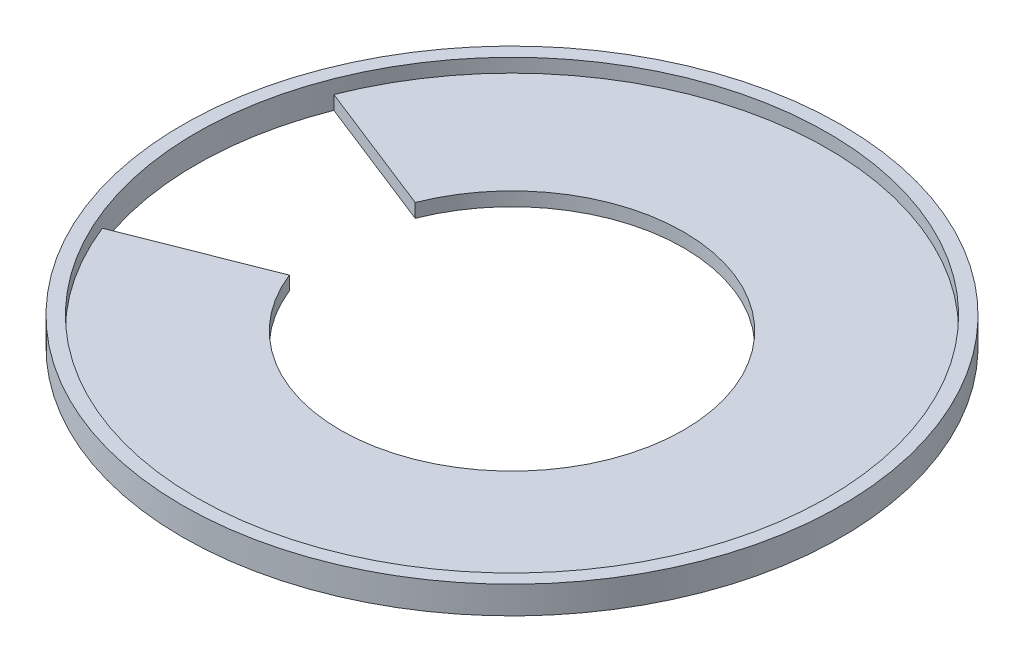
ISO-10303-21;
HEADER;
FILE_DESCRIPTION(('STEP AP214'),'2;1');
FILE_NAME('part.step','',(''),(''),'','','');
FILE_SCHEMA(('AUTOMOTIVE_DESIGN { 1 0 10303 214 1 1 1 1 }'));
ENDSEC;
DATA;
#1=APPLICATION_CONTEXT('core data for automotive mechanical design processes');
#2=APPLICATION_PROTOCOL_DEFINITION('international standard','automotive_design',2000,#1);
#3=PRODUCT_CONTEXT('',#1,'mechanical');
#4=PRODUCT('Part','Part','',(#3));
#5=PRODUCT_RELATED_PRODUCT_CATEGORY('part','',(#4));
#6=PRODUCT_DEFINITION_FORMATION('','',#4);
#7=PRODUCT_DEFINITION_CONTEXT('part definition',#1,'design');
#8=PRODUCT_DEFINITION('design','',#6,#7);
#9=PRODUCT_DEFINITION_SHAPE('','',#8);
#10=(LENGTH_UNIT() NAMED_UNIT(*) SI_UNIT(.MILLI.,.METRE.));
#11=(NAMED_UNIT(*) PLANE_ANGLE_UNIT() SI_UNIT($,.RADIAN.));
#12=(NAMED_UNIT(*) SI_UNIT($,.STERADIAN.) SOLID_ANGLE_UNIT());
#13=UNCERTAINTY_MEASURE_WITH_UNIT(LENGTH_MEASURE(1.E-05),#10,'distance_accuracy_value','');
#14=(GEOMETRIC_REPRESENTATION_CONTEXT(3) GLOBAL_UNCERTAINTY_ASSIGNED_CONTEXT((#13)) GLOBAL_UNIT_ASSIGNED_CONTEXT((#10,
#11,#12)) REPRESENTATION_CONTEXT('',''));
#15=CARTESIAN_POINT('',(0.,0.,0.));
#16=DIRECTION('',(0.,0.,1.));
#17=DIRECTION('',(1.,0.,0.));
#18=AXIS2_PLACEMENT_3D('',#15,#16,#17);
#19=CARTESIAN_POINT('',(0.,4.,0.));
#20=DIRECTION('',(0.,-1.,0.));
#21=DIRECTION('',(0.,0.,-1.));
#22=AXIS2_PLACEMENT_3D('',#19,#20,#21);
#23=CYLINDRICAL_SURFACE('',#22,46.);
#24=CARTESIAN_POINT('',(0.,4.,0.));
#25=DIRECTION('',(0.,1.,0.));
#26=DIRECTION('',(0.,0.,1.));
#27=AXIS2_PLACEMENT_3D('',#24,#25,#26);
#28=CIRCLE('',#27,46.);
#29=CARTESIAN_POINT('',(0.,4.,46.));
#30=VERTEX_POINT('',#29);
#31=EDGE_CURVE('E50',#30,#30,#28,.T.);
#32=ORIENTED_EDGE('',*,*,#31,.T.);
#33=EDGE_LOOP('',(#32));
#34=FACE_BOUND('',#33,.T.);
#35=CARTESIAN_POINT('',(0.,2.,0.));
#36=DIRECTION('',(0.,1.,0.));
#37=DIRECTION('',(0.,0.,1.));
#38=AXIS2_PLACEMENT_3D('',#35,#36,#37);
#39=CIRCLE('',#38,46.);
#40=CARTESIAN_POINT('',(-42.7992081271732,2.,16.8590564293174));
#41=VERTEX_POINT('',#40);
#42=CARTESIAN_POINT('',(-42.7992081271732,2.,-16.8590564293174));
#43=VERTEX_POINT('',#42);
#44=EDGE_CURVE('E92',#41,#43,#39,.T.);
#45=ORIENTED_EDGE('',*,*,#44,.F.);
#46=DIRECTION('',(0.,-1.,0.));
#47=VECTOR('',#46,1.);
#48=CARTESIAN_POINT('',(-42.7992081271732,2.,16.8590564293174));
#49=LINE('',#48,#47);
#50=CARTESIAN_POINT('',(-42.7992081271732,0.,16.8590564293174));
#51=VERTEX_POINT('',#50);
#52=EDGE_CURVE('E111',#41,#51,#49,.T.);
#53=ORIENTED_EDGE('',*,*,#52,.T.);
#54=CARTESIAN_POINT('',(0.,0.,0.));
#55=DIRECTION('',(0.,1.,0.));
#56=DIRECTION('',(0.,0.,1.));
#57=AXIS2_PLACEMENT_3D('',#54,#55,#56);
#58=CIRCLE('',#57,46.);
#59=CARTESIAN_POINT('',(-42.7992081271732,0.,-16.8590564293174));
#60=VERTEX_POINT('',#59);
#61=EDGE_CURVE('E109',#60,#51,#58,.T.);
#62=ORIENTED_EDGE('',*,*,#61,.F.);
#63=DIRECTION('',(0.,-1.,0.));
#64=VECTOR('',#63,1.);
#65=CARTESIAN_POINT('',(-42.7992081271732,2.,-16.8590564293174));
#66=LINE('',#65,#64);
#67=EDGE_CURVE('E103',#43,#60,#66,.T.);
#68=ORIENTED_EDGE('',*,*,#67,.F.);
#69=EDGE_LOOP('',(#45,#53,#62,#68));
#70=FACE_BOUND('',#69,.T.);
#71=ADVANCED_FACE('F41',(#34,#70),#23,.F.);
#72=CARTESIAN_POINT('',(0.,4.,0.));
#73=DIRECTION('',(0.,-1.,0.));
#74=DIRECTION('',(0.,0.,-1.));
#75=AXIS2_PLACEMENT_3D('',#72,#73,#74);
#76=CYLINDRICAL_SURFACE('',#75,48.);
#77=CARTESIAN_POINT('',(0.,4.,0.));
#78=DIRECTION('',(0.,1.,0.));
#79=DIRECTION('',(0.,0.,1.));
#80=AXIS2_PLACEMENT_3D('',#77,#78,#79);
#81=CIRCLE('',#80,48.);
#82=CARTESIAN_POINT('',(0.,4.,48.));
#83=VERTEX_POINT('',#82);
#84=EDGE_CURVE('E11',#83,#83,#81,.T.);
#85=ORIENTED_EDGE('',*,*,#84,.F.);
#86=EDGE_LOOP('',(#85));
#87=FACE_BOUND('',#86,.T.);
#88=CARTESIAN_POINT('',(0.,0.,0.));
#89=DIRECTION('',(0.,1.,0.));
#90=DIRECTION('',(0.,0.,1.));
#91=AXIS2_PLACEMENT_3D('',#88,#89,#90);
#92=CIRCLE('',#91,48.);
#93=CARTESIAN_POINT('',(0.,0.,48.));
#94=VERTEX_POINT('',#93);
#95=EDGE_CURVE('E44',#94,#94,#92,.T.);
#96=ORIENTED_EDGE('',*,*,#95,.T.);
#97=EDGE_LOOP('',(#96));
#98=FACE_BOUND('',#97,.T.);
#99=ADVANCED_FACE('F126',(#87,#98),#76,.T.);
#100=CARTESIAN_POINT('',(0.,4.,0.));
#101=DIRECTION('',(0.,1.,0.));
#102=DIRECTION('',(0.,0.,1.));
#103=AXIS2_PLACEMENT_3D('',#100,#101,#102);
#104=PLANE('',#103);
#105=ORIENTED_EDGE('',*,*,#31,.F.);
#106=EDGE_LOOP('',(#105));
#107=FACE_BOUND('',#106,.T.);
#108=ORIENTED_EDGE('',*,*,#84,.T.);
#109=EDGE_LOOP('',(#108));
#110=FACE_BOUND('',#109,.T.);
#111=ADVANCED_FACE('F131',(#107,#110),#104,.T.);
#112=CARTESIAN_POINT('',(0.,0.,0.));
#113=DIRECTION('',(0.,1.,0.));
#114=DIRECTION('',(0.,0.,1.));
#115=AXIS2_PLACEMENT_3D('',#112,#113,#114);
#116=PLANE('',#115);
#117=ORIENTED_EDGE('',*,*,#61,.T.);
#118=DIRECTION('',(-0.930417567982027,0.,0.366501226724291));
#119=VECTOR('',#118,1.);
#120=CARTESIAN_POINT('',(0.,0.,0.));
#121=LINE('',#120,#119);
#122=CARTESIAN_POINT('',(-23.2604391995507,0.,9.16253066810728));
#123=VERTEX_POINT('',#122);
#124=EDGE_CURVE('E205',#123,#51,#121,.T.);
#125=ORIENTED_EDGE('',*,*,#124,.F.);
#126=CARTESIAN_POINT('',(0.,0.,0.));
#127=DIRECTION('',(0.,1.,0.));
#128=DIRECTION('',(0.,0.,1.));
#129=AXIS2_PLACEMENT_3D('',#126,#127,#128);
#130=CIRCLE('',#129,25.);
#131=CARTESIAN_POINT('',(-23.2604391995507,0.,-9.16253066810728));
#132=VERTEX_POINT('',#131);
#133=EDGE_CURVE('E199',#123,#132,#130,.T.);
#134=ORIENTED_EDGE('',*,*,#133,.T.);
#135=DIRECTION('',(-0.930417567982027,0.,-0.366501226724291));
#136=VECTOR('',#135,1.);
#137=CARTESIAN_POINT('',(0.,0.,0.));
#138=LINE('',#137,#136);
#139=EDGE_CURVE('E58',#132,#60,#138,.T.);
#140=ORIENTED_EDGE('',*,*,#139,.T.);
#141=EDGE_LOOP('',(#117,#125,#134,#140));
#142=FACE_BOUND('',#141,.T.);
#143=ORIENTED_EDGE('',*,*,#95,.F.);
#144=EDGE_LOOP('',(#143));
#145=FACE_BOUND('',#144,.T.);
#146=ADVANCED_FACE('F128',(#142,#145),#116,.F.);
#147=CARTESIAN_POINT('',(0.,2.,0.));
#148=DIRECTION('',(0.366501226724291,0.,0.930417567982027));
#149=DIRECTION('',(0.930417567982027,0.,-0.366501226724291));
#150=AXIS2_PLACEMENT_3D('',#147,#148,#149);
#151=PLANE('',#150);
#152=ORIENTED_EDGE('',*,*,#124,.T.);
#153=ORIENTED_EDGE('',*,*,#52,.F.);
#154=DIRECTION('',(-0.930417567982027,0.,0.366501226724291));
#155=VECTOR('',#154,1.);
#156=CARTESIAN_POINT('',(0.,2.,0.));
#157=LINE('',#156,#155);
#158=CARTESIAN_POINT('',(-23.2604391995507,2.,9.16253066810728));
#159=VERTEX_POINT('',#158);
#160=EDGE_CURVE('E88',#159,#41,#157,.T.);
#161=ORIENTED_EDGE('',*,*,#160,.F.);
#162=DIRECTION('',(0.,-1.,0.));
#163=VECTOR('',#162,1.);
#164=CARTESIAN_POINT('',(-23.2604391995507,2.,9.16253066810728));
#165=LINE('',#164,#163);
#166=EDGE_CURVE('E67',#159,#123,#165,.T.);
#167=ORIENTED_EDGE('',*,*,#166,.T.);
#168=EDGE_LOOP('',(#152,#153,#161,#167));
#169=FACE_BOUND('',#168,.T.);
#170=ADVANCED_FACE('F130',(#169),#151,.F.);
#171=CARTESIAN_POINT('',(0.,2.,0.));
#172=DIRECTION('',(-0.366501226724291,0.,0.930417567982027));
#173=DIRECTION('',(0.930417567982027,0.,0.366501226724291));
#174=AXIS2_PLACEMENT_3D('',#171,#172,#173);
#175=PLANE('',#174);
#176=ORIENTED_EDGE('',*,*,#139,.F.);
#177=DIRECTION('',(0.,-1.,0.));
#178=VECTOR('',#177,1.);
#179=CARTESIAN_POINT('',(-23.2604391995507,2.,-9.16253066810728));
#180=LINE('',#179,#178);
#181=CARTESIAN_POINT('',(-23.2604391995507,2.,-9.16253066810728));
#182=VERTEX_POINT('',#181);
#183=EDGE_CURVE('E105',#182,#132,#180,.T.);
#184=ORIENTED_EDGE('',*,*,#183,.F.);
#185=DIRECTION('',(-0.930417567982027,0.,-0.366501226724291));
#186=VECTOR('',#185,1.);
#187=CARTESIAN_POINT('',(0.,2.,0.));
#188=LINE('',#187,#186);
#189=EDGE_CURVE('E95',#182,#43,#188,.T.);
#190=ORIENTED_EDGE('',*,*,#189,.T.);
#191=ORIENTED_EDGE('',*,*,#67,.T.);
#192=EDGE_LOOP('',(#176,#184,#190,#191));
#193=FACE_BOUND('',#192,.T.);
#194=ADVANCED_FACE('F102',(#193),#175,.T.);
#195=CARTESIAN_POINT('',(0.,2.,0.));
#196=DIRECTION('',(0.,-1.,0.));
#197=DIRECTION('',(0.,0.,-1.));
#198=AXIS2_PLACEMENT_3D('',#195,#196,#197);
#199=CYLINDRICAL_SURFACE('',#198,25.);
#200=ORIENTED_EDGE('',*,*,#133,.F.);
#201=ORIENTED_EDGE('',*,*,#166,.F.);
#202=CARTESIAN_POINT('',(0.,2.,0.));
#203=DIRECTION('',(0.,1.,0.));
#204=DIRECTION('',(0.,0.,1.));
#205=AXIS2_PLACEMENT_3D('',#202,#203,#204);
#206=CIRCLE('',#205,25.);
#207=EDGE_CURVE('E107',#159,#182,#206,.T.);
#208=ORIENTED_EDGE('',*,*,#207,.T.);
#209=ORIENTED_EDGE('',*,*,#183,.T.);
#210=EDGE_LOOP('',(#200,#201,#208,#209));
#211=FACE_BOUND('',#210,.T.);
#212=ADVANCED_FACE('F179',(#211),#199,.F.);
#213=CARTESIAN_POINT('',(0.,2.,0.));
#214=DIRECTION('',(0.,1.,0.));
#215=DIRECTION('',(0.,0.,1.));
#216=AXIS2_PLACEMENT_3D('',#213,#214,#215);
#217=PLANE('',#216);
#218=ORIENTED_EDGE('',*,*,#160,.T.);
#219=ORIENTED_EDGE('',*,*,#44,.T.);
#220=ORIENTED_EDGE('',*,*,#189,.F.);
#221=ORIENTED_EDGE('',*,*,#207,.F.);
#222=EDGE_LOOP('',(#218,#219,#220,#221));
#223=FACE_BOUND('',#222,.T.);
#224=ADVANCED_FACE('F94',(#223),#217,.T.);
#225=CLOSED_SHELL('',(#71,#99,#111,#146,#170,#194,#212,#224));
#226=MANIFOLD_SOLID_BREP('B2',#225);
#227=ADVANCED_BREP_SHAPE_REPRESENTATION('',(#18,#226),#14);
#228=SHAPE_DEFINITION_REPRESENTATION(#9,#227);
ENDSEC;
END-ISO-10303-21;
